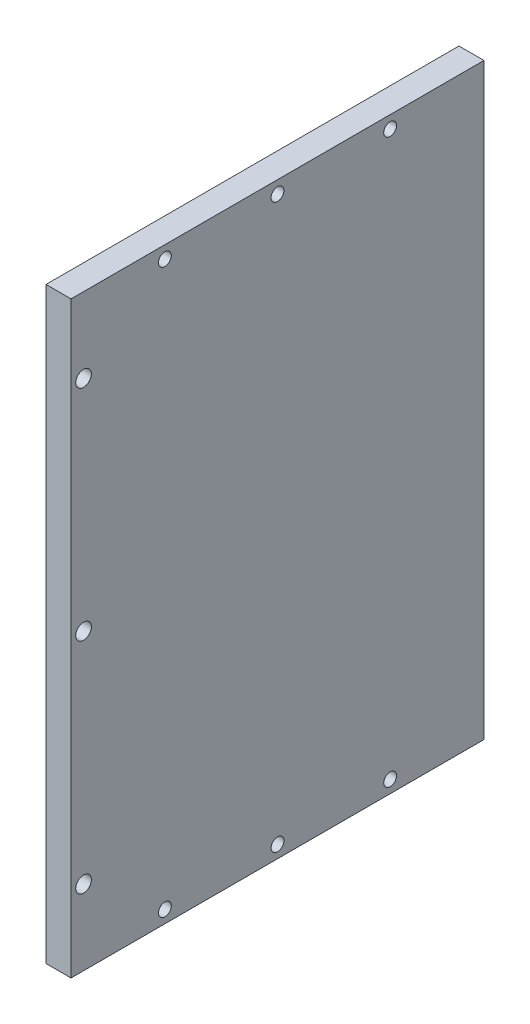
ISO-10303-21;
HEADER;
FILE_DESCRIPTION(('STEP AP214'),'2;1');
FILE_NAME('part.step','',(''),(''),'','','');
FILE_SCHEMA(('AUTOMOTIVE_DESIGN { 1 0 10303 214 1 1 1 1 }'));
ENDSEC;
DATA;
#1=APPLICATION_CONTEXT('core data for automotive mechanical design processes');
#2=APPLICATION_PROTOCOL_DEFINITION('international standard','automotive_design',2000,#1);
#3=PRODUCT_CONTEXT('',#1,'mechanical');
#4=PRODUCT('Part','Part','',(#3));
#5=PRODUCT_RELATED_PRODUCT_CATEGORY('part','',(#4));
#6=PRODUCT_DEFINITION_FORMATION('','',#4);
#7=PRODUCT_DEFINITION_CONTEXT('part definition',#1,'design');
#8=PRODUCT_DEFINITION('design','',#6,#7);
#9=PRODUCT_DEFINITION_SHAPE('','',#8);
#10=(LENGTH_UNIT() NAMED_UNIT(*) SI_UNIT(.MILLI.,.METRE.));
#11=(NAMED_UNIT(*) PLANE_ANGLE_UNIT() SI_UNIT($,.RADIAN.));
#12=(NAMED_UNIT(*) SI_UNIT($,.STERADIAN.) SOLID_ANGLE_UNIT());
#13=UNCERTAINTY_MEASURE_WITH_UNIT(LENGTH_MEASURE(1.E-05),#10,'distance_accuracy_value','');
#14=(GEOMETRIC_REPRESENTATION_CONTEXT(3) GLOBAL_UNCERTAINTY_ASSIGNED_CONTEXT((#13)) GLOBAL_UNIT_ASSIGNED_CONTEXT((#10,
#11,#12)) REPRESENTATION_CONTEXT('',''));
#15=CARTESIAN_POINT('',(0.,0.,0.));
#16=DIRECTION('',(0.,0.,1.));
#17=DIRECTION('',(1.,0.,0.));
#18=AXIS2_PLACEMENT_3D('',#15,#16,#17);
#19=CARTESIAN_POINT('',(4.,0.,0.));
#20=DIRECTION('',(-1.,0.,0.));
#21=DIRECTION('',(0.,0.,1.));
#22=AXIS2_PLACEMENT_3D('',#19,#20,#21);
#23=PLANE('',#22);
#24=CARTESIAN_POINT('',(4.,45.,-15.));
#25=DIRECTION('',(1.,0.,0.));
#26=DIRECTION('',(0.,0.,-1.));
#27=AXIS2_PLACEMENT_3D('',#24,#25,#26);
#28=CIRCLE('',#27,1.02499999999998);
#29=CARTESIAN_POINT('',(4.,45.,-16.025));
#30=VERTEX_POINT('',#29);
#31=EDGE_CURVE('E125',#30,#30,#28,.T.);
#32=ORIENTED_EDGE('',*,*,#31,.F.);
#33=EDGE_LOOP('',(#32));
#34=FACE_BOUND('',#33,.T.);
#35=CARTESIAN_POINT('',(4.,45.,-51.));
#36=DIRECTION('',(1.,0.,0.));
#37=DIRECTION('',(0.,0.,-1.));
#38=AXIS2_PLACEMENT_3D('',#35,#36,#37);
#39=CIRCLE('',#38,1.02499999999998);
#40=CARTESIAN_POINT('',(4.,45.,-52.025));
#41=VERTEX_POINT('',#40);
#42=EDGE_CURVE('E131',#41,#41,#39,.T.);
#43=ORIENTED_EDGE('',*,*,#42,.F.);
#44=EDGE_LOOP('',(#43));
#45=FACE_BOUND('',#44,.T.);
#46=CARTESIAN_POINT('',(4.,-45.,-15.));
#47=DIRECTION('',(1.,0.,0.));
#48=DIRECTION('',(0.,0.,-1.));
#49=AXIS2_PLACEMENT_3D('',#46,#47,#48);
#50=CIRCLE('',#49,1.02499999999998);
#51=CARTESIAN_POINT('',(4.,-45.,-16.025));
#52=VERTEX_POINT('',#51);
#53=EDGE_CURVE('E137',#52,#52,#50,.T.);
#54=ORIENTED_EDGE('',*,*,#53,.F.);
#55=EDGE_LOOP('',(#54));
#56=FACE_BOUND('',#55,.T.);
#57=CARTESIAN_POINT('',(4.,-45.,-51.));
#58=DIRECTION('',(1.,0.,0.));
#59=DIRECTION('',(0.,0.,-1.));
#60=AXIS2_PLACEMENT_3D('',#57,#58,#59);
#61=CIRCLE('',#60,1.02499999999998);
#62=CARTESIAN_POINT('',(4.,-45.,-52.025));
#63=VERTEX_POINT('',#62);
#64=EDGE_CURVE('E143',#63,#63,#61,.T.);
#65=ORIENTED_EDGE('',*,*,#64,.F.);
#66=EDGE_LOOP('',(#65));
#67=FACE_BOUND('',#66,.T.);
#68=CARTESIAN_POINT('',(4.,-45.,-33.));
#69=DIRECTION('',(1.,0.,0.));
#70=DIRECTION('',(0.,0.,-1.));
#71=AXIS2_PLACEMENT_3D('',#68,#69,#70);
#72=CIRCLE('',#71,1.02499999999998);
#73=CARTESIAN_POINT('',(4.,-45.,-34.025));
#74=VERTEX_POINT('',#73);
#75=EDGE_CURVE('E149',#74,#74,#72,.T.);
#76=ORIENTED_EDGE('',*,*,#75,.F.);
#77=EDGE_LOOP('',(#76));
#78=FACE_BOUND('',#77,.T.);
#79=CARTESIAN_POINT('',(4.,45.,-33.));
#80=DIRECTION('',(1.,0.,0.));
#81=DIRECTION('',(0.,0.,-1.));
#82=AXIS2_PLACEMENT_3D('',#79,#80,#81);
#83=CIRCLE('',#82,1.02499999999998);
#84=CARTESIAN_POINT('',(4.,45.,-34.025));
#85=VERTEX_POINT('',#84);
#86=EDGE_CURVE('E155',#85,#85,#83,.T.);
#87=ORIENTED_EDGE('',*,*,#86,.F.);
#88=EDGE_LOOP('',(#87));
#89=FACE_BOUND('',#88,.T.);
#90=DIRECTION('',(0.,-1.,0.));
#91=VECTOR('',#90,1.);
#92=CARTESIAN_POINT('',(4.,0.,0.));
#93=LINE('',#92,#91);
#94=CARTESIAN_POINT('',(4.,47.,0.));
#95=VERTEX_POINT('',#94);
#96=CARTESIAN_POINT('',(4.,-47.,0.));
#97=VERTEX_POINT('',#96);
#98=EDGE_CURVE('E56',#95,#97,#93,.T.);
#99=ORIENTED_EDGE('',*,*,#98,.T.);
#100=DIRECTION('',(0.,0.,-1.));
#101=VECTOR('',#100,1.);
#102=CARTESIAN_POINT('',(4.,-47.,-66.));
#103=LINE('',#102,#101);
#104=CARTESIAN_POINT('',(4.,-47.,-66.));
#105=VERTEX_POINT('',#104);
#106=EDGE_CURVE('E88',#97,#105,#103,.T.);
#107=ORIENTED_EDGE('',*,*,#106,.T.);
#108=DIRECTION('',(0.,1.,0.));
#109=VECTOR('',#108,1.);
#110=CARTESIAN_POINT('',(4.,47.,-66.));
#111=LINE('',#110,#109);
#112=CARTESIAN_POINT('',(4.,47.,-66.));
#113=VERTEX_POINT('',#112);
#114=EDGE_CURVE('E183',#105,#113,#111,.T.);
#115=ORIENTED_EDGE('',*,*,#114,.T.);
#116=DIRECTION('',(0.,0.,1.));
#117=VECTOR('',#116,1.);
#118=CARTESIAN_POINT('',(4.,47.,0.));
#119=LINE('',#118,#117);
#120=EDGE_CURVE('E185',#113,#95,#119,.T.);
#121=ORIENTED_EDGE('',*,*,#120,.T.);
#122=EDGE_LOOP('',(#99,#107,#115,#121));
#123=FACE_BOUND('',#122,.T.);
#124=CARTESIAN_POINT('',(4.,0.,-2.));
#125=DIRECTION('',(1.,0.,0.));
#126=DIRECTION('',(0.,0.,-1.));
#127=AXIS2_PLACEMENT_3D('',#124,#125,#126);
#128=CIRCLE('',#127,1.25);
#129=CARTESIAN_POINT('',(4.,0.,-3.25));
#130=VERTEX_POINT('',#129);
#131=EDGE_CURVE('E174',#130,#130,#128,.T.);
#132=ORIENTED_EDGE('',*,*,#131,.F.);
#133=EDGE_LOOP('',(#132));
#134=FACE_BOUND('',#133,.T.);
#135=CARTESIAN_POINT('',(4.,35.,-1.99999999999988));
#136=DIRECTION('',(1.,0.,0.));
#137=DIRECTION('',(0.,0.,-1.));
#138=AXIS2_PLACEMENT_3D('',#135,#136,#137);
#139=CIRCLE('',#138,1.25);
#140=CARTESIAN_POINT('',(4.,35.,-3.24999999999988));
#141=VERTEX_POINT('',#140);
#142=EDGE_CURVE('E168',#141,#141,#139,.T.);
#143=ORIENTED_EDGE('',*,*,#142,.F.);
#144=EDGE_LOOP('',(#143));
#145=FACE_BOUND('',#144,.T.);
#146=CARTESIAN_POINT('',(4.,-35.,-2.00000000000037));
#147=DIRECTION('',(1.,0.,0.));
#148=DIRECTION('',(0.,0.,-1.));
#149=AXIS2_PLACEMENT_3D('',#146,#147,#148);
#150=CIRCLE('',#149,1.25);
#151=CARTESIAN_POINT('',(4.,-35.,-3.25000000000037));
#152=VERTEX_POINT('',#151);
#153=EDGE_CURVE('E162',#152,#152,#150,.T.);
#154=ORIENTED_EDGE('',*,*,#153,.F.);
#155=EDGE_LOOP('',(#154));
#156=FACE_BOUND('',#155,.T.);
#157=ADVANCED_FACE('F39',(#34,#45,#56,#67,#78,#89,#123,#134,#145,#156),#23,.F.);
#158=CARTESIAN_POINT('',(0.,0.,0.));
#159=DIRECTION('',(-1.,0.,0.));
#160=DIRECTION('',(0.,0.,1.));
#161=AXIS2_PLACEMENT_3D('',#158,#159,#160);
#162=PLANE('',#161);
#163=CARTESIAN_POINT('',(0.,45.,-15.));
#164=DIRECTION('',(1.,0.,0.));
#165=DIRECTION('',(0.,0.,-1.));
#166=AXIS2_PLACEMENT_3D('',#163,#164,#165);
#167=CIRCLE('',#166,1.025);
#168=CARTESIAN_POINT('',(0.,45.,-16.025));
#169=VERTEX_POINT('',#168);
#170=EDGE_CURVE('E128',#169,#169,#167,.T.);
#171=ORIENTED_EDGE('',*,*,#170,.T.);
#172=EDGE_LOOP('',(#171));
#173=FACE_BOUND('',#172,.T.);
#174=CARTESIAN_POINT('',(0.,45.,-51.));
#175=DIRECTION('',(1.,0.,0.));
#176=DIRECTION('',(0.,0.,-1.));
#177=AXIS2_PLACEMENT_3D('',#174,#175,#176);
#178=CIRCLE('',#177,1.025);
#179=CARTESIAN_POINT('',(0.,45.,-52.025));
#180=VERTEX_POINT('',#179);
#181=EDGE_CURVE('E134',#180,#180,#178,.T.);
#182=ORIENTED_EDGE('',*,*,#181,.T.);
#183=EDGE_LOOP('',(#182));
#184=FACE_BOUND('',#183,.T.);
#185=CARTESIAN_POINT('',(0.,-45.,-15.));
#186=DIRECTION('',(1.,0.,0.));
#187=DIRECTION('',(0.,0.,-1.));
#188=AXIS2_PLACEMENT_3D('',#185,#186,#187);
#189=CIRCLE('',#188,1.025);
#190=CARTESIAN_POINT('',(0.,-45.,-16.025));
#191=VERTEX_POINT('',#190);
#192=EDGE_CURVE('E140',#191,#191,#189,.T.);
#193=ORIENTED_EDGE('',*,*,#192,.T.);
#194=EDGE_LOOP('',(#193));
#195=FACE_BOUND('',#194,.T.);
#196=CARTESIAN_POINT('',(0.,-45.,-51.));
#197=DIRECTION('',(1.,0.,0.));
#198=DIRECTION('',(0.,0.,-1.));
#199=AXIS2_PLACEMENT_3D('',#196,#197,#198);
#200=CIRCLE('',#199,1.025);
#201=CARTESIAN_POINT('',(0.,-45.,-52.025));
#202=VERTEX_POINT('',#201);
#203=EDGE_CURVE('E146',#202,#202,#200,.T.);
#204=ORIENTED_EDGE('',*,*,#203,.T.);
#205=EDGE_LOOP('',(#204));
#206=FACE_BOUND('',#205,.T.);
#207=CARTESIAN_POINT('',(0.,-45.,-33.));
#208=DIRECTION('',(1.,0.,0.));
#209=DIRECTION('',(0.,0.,-1.));
#210=AXIS2_PLACEMENT_3D('',#207,#208,#209);
#211=CIRCLE('',#210,1.025);
#212=CARTESIAN_POINT('',(0.,-45.,-34.025));
#213=VERTEX_POINT('',#212);
#214=EDGE_CURVE('E152',#213,#213,#211,.T.);
#215=ORIENTED_EDGE('',*,*,#214,.T.);
#216=EDGE_LOOP('',(#215));
#217=FACE_BOUND('',#216,.T.);
#218=CARTESIAN_POINT('',(0.,45.,-33.));
#219=DIRECTION('',(1.,0.,0.));
#220=DIRECTION('',(0.,0.,-1.));
#221=AXIS2_PLACEMENT_3D('',#218,#219,#220);
#222=CIRCLE('',#221,1.025);
#223=CARTESIAN_POINT('',(0.,45.,-34.025));
#224=VERTEX_POINT('',#223);
#225=EDGE_CURVE('E158',#224,#224,#222,.T.);
#226=ORIENTED_EDGE('',*,*,#225,.T.);
#227=EDGE_LOOP('',(#226));
#228=FACE_BOUND('',#227,.T.);
#229=CARTESIAN_POINT('',(0.,35.,-1.99999999999988));
#230=DIRECTION('',(1.,0.,0.));
#231=DIRECTION('',(0.,0.,-1.));
#232=AXIS2_PLACEMENT_3D('',#229,#230,#231);
#233=CIRCLE('',#232,1.25);
#234=CARTESIAN_POINT('',(0.,35.,-3.24999999999988));
#235=VERTEX_POINT('',#234);
#236=EDGE_CURVE('E165',#235,#235,#233,.T.);
#237=ORIENTED_EDGE('',*,*,#236,.T.);
#238=EDGE_LOOP('',(#237));
#239=FACE_BOUND('',#238,.T.);
#240=DIRECTION('',(0.,0.,-1.));
#241=VECTOR('',#240,1.);
#242=CARTESIAN_POINT('',(0.,-47.,-66.));
#243=LINE('',#242,#241);
#244=CARTESIAN_POINT('',(0.,-47.,0.));
#245=VERTEX_POINT('',#244);
#246=CARTESIAN_POINT('',(0.,-47.,-66.));
#247=VERTEX_POINT('',#246);
#248=EDGE_CURVE('E177',#245,#247,#243,.T.);
#249=ORIENTED_EDGE('',*,*,#248,.F.);
#250=DIRECTION('',(0.,-1.,0.));
#251=VECTOR('',#250,1.);
#252=CARTESIAN_POINT('',(0.,0.,0.));
#253=LINE('',#252,#251);
#254=CARTESIAN_POINT('',(0.,47.,0.));
#255=VERTEX_POINT('',#254);
#256=EDGE_CURVE('E181',#255,#245,#253,.T.);
#257=ORIENTED_EDGE('',*,*,#256,.F.);
#258=DIRECTION('',(0.,0.,1.));
#259=VECTOR('',#258,1.);
#260=CARTESIAN_POINT('',(0.,47.,0.));
#261=LINE('',#260,#259);
#262=CARTESIAN_POINT('',(0.,47.,-66.));
#263=VERTEX_POINT('',#262);
#264=EDGE_CURVE('E82',#263,#255,#261,.T.);
#265=ORIENTED_EDGE('',*,*,#264,.F.);
#266=DIRECTION('',(0.,1.,0.));
#267=VECTOR('',#266,1.);
#268=CARTESIAN_POINT('',(0.,47.,-66.));
#269=LINE('',#268,#267);
#270=EDGE_CURVE('E75',#247,#263,#269,.T.);
#271=ORIENTED_EDGE('',*,*,#270,.F.);
#272=EDGE_LOOP('',(#249,#257,#265,#271));
#273=FACE_BOUND('',#272,.T.);
#274=CARTESIAN_POINT('',(0.,0.,-2.));
#275=DIRECTION('',(1.,0.,0.));
#276=DIRECTION('',(0.,0.,-1.));
#277=AXIS2_PLACEMENT_3D('',#274,#275,#276);
#278=CIRCLE('',#277,1.25);
#279=CARTESIAN_POINT('',(0.,0.,-3.25));
#280=VERTEX_POINT('',#279);
#281=EDGE_CURVE('E171',#280,#280,#278,.T.);
#282=ORIENTED_EDGE('',*,*,#281,.T.);
#283=EDGE_LOOP('',(#282));
#284=FACE_BOUND('',#283,.T.);
#285=CARTESIAN_POINT('',(0.,-35.,-2.00000000000037));
#286=DIRECTION('',(1.,0.,0.));
#287=DIRECTION('',(0.,0.,-1.));
#288=AXIS2_PLACEMENT_3D('',#285,#286,#287);
#289=CIRCLE('',#288,1.25);
#290=CARTESIAN_POINT('',(0.,-35.,-3.25000000000037));
#291=VERTEX_POINT('',#290);
#292=EDGE_CURVE('E161',#291,#291,#289,.T.);
#293=ORIENTED_EDGE('',*,*,#292,.T.);
#294=EDGE_LOOP('',(#293));
#295=FACE_BOUND('',#294,.T.);
#296=ADVANCED_FACE('F198',(#173,#184,#195,#206,#217,#228,#239,#273,#284,#295),#162,.T.);
#297=CARTESIAN_POINT('',(4.,-47.,-66.));
#298=DIRECTION('',(0.,1.,0.));
#299=DIRECTION('',(0.,0.,1.));
#300=AXIS2_PLACEMENT_3D('',#297,#298,#299);
#301=PLANE('',#300);
#302=ORIENTED_EDGE('',*,*,#248,.T.);
#303=DIRECTION('',(-1.,0.,0.));
#304=VECTOR('',#303,1.);
#305=CARTESIAN_POINT('',(4.,-47.,-66.));
#306=LINE('',#305,#304);
#307=EDGE_CURVE('E48',#105,#247,#306,.T.);
#308=ORIENTED_EDGE('',*,*,#307,.F.);
#309=ORIENTED_EDGE('',*,*,#106,.F.);
#310=DIRECTION('',(-1.,0.,0.));
#311=VECTOR('',#310,1.);
#312=CARTESIAN_POINT('',(4.,-47.,0.));
#313=LINE('',#312,#311);
#314=EDGE_CURVE('E11',#97,#245,#313,.T.);
#315=ORIENTED_EDGE('',*,*,#314,.T.);
#316=EDGE_LOOP('',(#302,#308,#309,#315));
#317=FACE_BOUND('',#316,.T.);
#318=ADVANCED_FACE('F41',(#317),#301,.F.);
#319=CARTESIAN_POINT('',(4.,47.,-66.));
#320=DIRECTION('',(0.,0.,1.));
#321=DIRECTION('',(1.,0.,0.));
#322=AXIS2_PLACEMENT_3D('',#319,#320,#321);
#323=PLANE('',#322);
#324=CARTESIAN_POINT('',(2.00000000000012,35.,-66.));
#325=DIRECTION('',(0.,0.,-1.));
#326=DIRECTION('',(-1.,0.,0.));
#327=AXIS2_PLACEMENT_3D('',#324,#325,#326);
#328=CIRCLE('',#327,1.02499999999999);
#329=CARTESIAN_POINT('',(0.975000000000133,35.,-66.));
#330=VERTEX_POINT('',#329);
#331=EDGE_CURVE('E109',#330,#330,#328,.T.);
#332=ORIENTED_EDGE('',*,*,#331,.F.);
#333=EDGE_LOOP('',(#332));
#334=FACE_BOUND('',#333,.T.);
#335=CARTESIAN_POINT('',(2.,0.,-66.));
#336=DIRECTION('',(0.,0.,-1.));
#337=DIRECTION('',(-1.,0.,0.));
#338=AXIS2_PLACEMENT_3D('',#335,#336,#337);
#339=CIRCLE('',#338,1.02499999999999);
#340=CARTESIAN_POINT('',(0.975000000000011,0.,-66.));
#341=VERTEX_POINT('',#340);
#342=EDGE_CURVE('E108',#341,#341,#339,.T.);
#343=ORIENTED_EDGE('',*,*,#342,.F.);
#344=EDGE_LOOP('',(#343));
#345=FACE_BOUND('',#344,.T.);
#346=CARTESIAN_POINT('',(1.99999999999963,-35.,-66.));
#347=DIRECTION('',(0.,0.,-1.));
#348=DIRECTION('',(-1.,0.,0.));
#349=AXIS2_PLACEMENT_3D('',#346,#347,#348);
#350=CIRCLE('',#349,1.02499999999999);
#351=CARTESIAN_POINT('',(0.974999999999644,-35.,-66.));
#352=VERTEX_POINT('',#351);
#353=EDGE_CURVE('E119',#352,#352,#350,.T.);
#354=ORIENTED_EDGE('',*,*,#353,.F.);
#355=EDGE_LOOP('',(#354));
#356=FACE_BOUND('',#355,.T.);
#357=ORIENTED_EDGE('',*,*,#270,.T.);
#358=DIRECTION('',(-1.,0.,0.));
#359=VECTOR('',#358,1.);
#360=CARTESIAN_POINT('',(4.,47.,-66.));
#361=LINE('',#360,#359);
#362=EDGE_CURVE('E193',#113,#263,#361,.T.);
#363=ORIENTED_EDGE('',*,*,#362,.F.);
#364=ORIENTED_EDGE('',*,*,#114,.F.);
#365=ORIENTED_EDGE('',*,*,#307,.T.);
#366=EDGE_LOOP('',(#357,#363,#364,#365));
#367=FACE_BOUND('',#366,.T.);
#368=ADVANCED_FACE('F195',(#334,#345,#356,#367),#323,.F.);
#369=CARTESIAN_POINT('',(4.,47.,0.));
#370=DIRECTION('',(0.,-1.,0.));
#371=DIRECTION('',(0.,0.,-1.));
#372=AXIS2_PLACEMENT_3D('',#369,#370,#371);
#373=PLANE('',#372);
#374=ORIENTED_EDGE('',*,*,#264,.T.);
#375=DIRECTION('',(-1.,0.,0.));
#376=VECTOR('',#375,1.);
#377=CARTESIAN_POINT('',(4.,47.,0.));
#378=LINE('',#377,#376);
#379=EDGE_CURVE('E187',#95,#255,#378,.T.);
#380=ORIENTED_EDGE('',*,*,#379,.F.);
#381=ORIENTED_EDGE('',*,*,#120,.F.);
#382=ORIENTED_EDGE('',*,*,#362,.T.);
#383=EDGE_LOOP('',(#374,#380,#381,#382));
#384=FACE_BOUND('',#383,.T.);
#385=ADVANCED_FACE('F203',(#384),#373,.F.);
#386=CARTESIAN_POINT('',(4.,0.,0.));
#387=DIRECTION('',(0.,0.,-1.));
#388=DIRECTION('',(-1.,0.,0.));
#389=AXIS2_PLACEMENT_3D('',#386,#387,#388);
#390=PLANE('',#389);
#391=ORIENTED_EDGE('',*,*,#256,.T.);
#392=ORIENTED_EDGE('',*,*,#314,.F.);
#393=ORIENTED_EDGE('',*,*,#98,.F.);
#394=ORIENTED_EDGE('',*,*,#379,.T.);
#395=EDGE_LOOP('',(#391,#392,#393,#394));
#396=FACE_BOUND('',#395,.T.);
#397=ADVANCED_FACE('F201',(#396),#390,.F.);
#398=CARTESIAN_POINT('',(4.,0.,-2.));
#399=DIRECTION('',(-1.,0.,0.));
#400=DIRECTION('',(0.,0.,1.));
#401=AXIS2_PLACEMENT_3D('',#398,#399,#400);
#402=CYLINDRICAL_SURFACE('',#401,1.25);
#403=ORIENTED_EDGE('',*,*,#131,.T.);
#404=EDGE_LOOP('',(#403));
#405=FACE_BOUND('',#404,.T.);
#406=ORIENTED_EDGE('',*,*,#281,.F.);
#407=EDGE_LOOP('',(#406));
#408=FACE_BOUND('',#407,.T.);
#409=ADVANCED_FACE('F234',(#405,#408),#402,.F.);
#410=CARTESIAN_POINT('',(4.,35.,-1.99999999999988));
#411=DIRECTION('',(-1.,0.,0.));
#412=DIRECTION('',(0.,0.,1.));
#413=AXIS2_PLACEMENT_3D('',#410,#411,#412);
#414=CYLINDRICAL_SURFACE('',#413,1.25);
#415=ORIENTED_EDGE('',*,*,#142,.T.);
#416=EDGE_LOOP('',(#415));
#417=FACE_BOUND('',#416,.T.);
#418=ORIENTED_EDGE('',*,*,#236,.F.);
#419=EDGE_LOOP('',(#418));
#420=FACE_BOUND('',#419,.T.);
#421=ADVANCED_FACE('F219',(#417,#420),#414,.F.);
#422=CARTESIAN_POINT('',(4.,-35.,-2.00000000000037));
#423=DIRECTION('',(-1.,0.,0.));
#424=DIRECTION('',(0.,0.,1.));
#425=AXIS2_PLACEMENT_3D('',#422,#423,#424);
#426=CYLINDRICAL_SURFACE('',#425,1.25);
#427=ORIENTED_EDGE('',*,*,#153,.T.);
#428=EDGE_LOOP('',(#427));
#429=FACE_BOUND('',#428,.T.);
#430=ORIENTED_EDGE('',*,*,#292,.F.);
#431=EDGE_LOOP('',(#430));
#432=FACE_BOUND('',#431,.T.);
#433=ADVANCED_FACE('F215',(#429,#432),#426,.F.);
#434=CARTESIAN_POINT('',(4.,45.,-33.));
#435=DIRECTION('',(1.,0.,0.));
#436=DIRECTION('',(0.,0.,-1.));
#437=AXIS2_PLACEMENT_3D('',#434,#435,#436);
#438=CYLINDRICAL_SURFACE('',#437,1.02499999999999);
#439=ORIENTED_EDGE('',*,*,#225,.F.);
#440=EDGE_LOOP('',(#439));
#441=FACE_BOUND('',#440,.T.);
#442=ORIENTED_EDGE('',*,*,#86,.T.);
#443=EDGE_LOOP('',(#442));
#444=FACE_BOUND('',#443,.T.);
#445=ADVANCED_FACE('F218',(#441,#444),#438,.F.);
#446=CARTESIAN_POINT('',(4.,-45.,-33.));
#447=DIRECTION('',(1.,0.,0.));
#448=DIRECTION('',(0.,0.,-1.));
#449=AXIS2_PLACEMENT_3D('',#446,#447,#448);
#450=CYLINDRICAL_SURFACE('',#449,1.02499999999999);
#451=ORIENTED_EDGE('',*,*,#214,.F.);
#452=EDGE_LOOP('',(#451));
#453=FACE_BOUND('',#452,.T.);
#454=ORIENTED_EDGE('',*,*,#75,.T.);
#455=EDGE_LOOP('',(#454));
#456=FACE_BOUND('',#455,.T.);
#457=ADVANCED_FACE('F280',(#453,#456),#450,.F.);
#458=CARTESIAN_POINT('',(4.,-45.,-51.));
#459=DIRECTION('',(1.,0.,0.));
#460=DIRECTION('',(0.,0.,-1.));
#461=AXIS2_PLACEMENT_3D('',#458,#459,#460);
#462=CYLINDRICAL_SURFACE('',#461,1.02499999999999);
#463=ORIENTED_EDGE('',*,*,#203,.F.);
#464=EDGE_LOOP('',(#463));
#465=FACE_BOUND('',#464,.T.);
#466=ORIENTED_EDGE('',*,*,#64,.T.);
#467=EDGE_LOOP('',(#466));
#468=FACE_BOUND('',#467,.T.);
#469=ADVANCED_FACE('F276',(#465,#468),#462,.F.);
#470=CARTESIAN_POINT('',(4.,-45.,-15.));
#471=DIRECTION('',(1.,0.,0.));
#472=DIRECTION('',(0.,0.,-1.));
#473=AXIS2_PLACEMENT_3D('',#470,#471,#472);
#474=CYLINDRICAL_SURFACE('',#473,1.02499999999999);
#475=ORIENTED_EDGE('',*,*,#192,.F.);
#476=EDGE_LOOP('',(#475));
#477=FACE_BOUND('',#476,.T.);
#478=ORIENTED_EDGE('',*,*,#53,.T.);
#479=EDGE_LOOP('',(#478));
#480=FACE_BOUND('',#479,.T.);
#481=ADVANCED_FACE('F272',(#477,#480),#474,.F.);
#482=CARTESIAN_POINT('',(4.,45.,-51.));
#483=DIRECTION('',(1.,0.,0.));
#484=DIRECTION('',(0.,0.,-1.));
#485=AXIS2_PLACEMENT_3D('',#482,#483,#484);
#486=CYLINDRICAL_SURFACE('',#485,1.02499999999999);
#487=ORIENTED_EDGE('',*,*,#181,.F.);
#488=EDGE_LOOP('',(#487));
#489=FACE_BOUND('',#488,.T.);
#490=ORIENTED_EDGE('',*,*,#42,.T.);
#491=EDGE_LOOP('',(#490));
#492=FACE_BOUND('',#491,.T.);
#493=ADVANCED_FACE('F268',(#489,#492),#486,.F.);
#494=CARTESIAN_POINT('',(4.,45.,-15.));
#495=DIRECTION('',(1.,0.,0.));
#496=DIRECTION('',(0.,0.,-1.));
#497=AXIS2_PLACEMENT_3D('',#494,#495,#496);
#498=CYLINDRICAL_SURFACE('',#497,1.02499999999999);
#499=ORIENTED_EDGE('',*,*,#170,.F.);
#500=EDGE_LOOP('',(#499));
#501=FACE_BOUND('',#500,.T.);
#502=ORIENTED_EDGE('',*,*,#31,.T.);
#503=EDGE_LOOP('',(#502));
#504=FACE_BOUND('',#503,.T.);
#505=ADVANCED_FACE('F260',(#501,#504),#498,.F.);
#506=CARTESIAN_POINT('',(1.99999999999963,-35.,-58.75));
#507=DIRECTION('',(0.,0.,-1.));
#508=DIRECTION('',(-1.,0.,0.));
#509=AXIS2_PLACEMENT_3D('',#506,#507,#508);
#510=CONICAL_SURFACE('',#509,1.02499999999999,1.02974425867665);
#511=CARTESIAN_POINT('',(1.99999999999963,-35.,-58.1341178654968));
#512=VERTEX_POINT('',#511);
#513=VERTEX_LOOP('',#512);
#514=FACE_BOUND('',#513,.T.);
#515=CARTESIAN_POINT('',(1.99999999999963,-35.,-58.75));
#516=DIRECTION('',(0.,0.,-1.));
#517=DIRECTION('',(-1.,0.,0.));
#518=AXIS2_PLACEMENT_3D('',#515,#516,#517);
#519=CIRCLE('',#518,1.02499999999999);
#520=CARTESIAN_POINT('',(0.974999999999646,-35.,-58.75));
#521=VERTEX_POINT('',#520);
#522=EDGE_CURVE('E122',#521,#521,#519,.T.);
#523=ORIENTED_EDGE('',*,*,#522,.T.);
#524=EDGE_LOOP('',(#523));
#525=FACE_BOUND('',#524,.T.);
#526=ADVANCED_FACE('F251',(#514,#525),#510,.F.);
#527=CARTESIAN_POINT('',(1.99999999999963,-35.,-66.));
#528=DIRECTION('',(0.,0.,-1.));
#529=DIRECTION('',(-1.,0.,0.));
#530=AXIS2_PLACEMENT_3D('',#527,#528,#529);
#531=CYLINDRICAL_SURFACE('',#530,1.02499999999999);
#532=ORIENTED_EDGE('',*,*,#522,.F.);
#533=EDGE_LOOP('',(#532));
#534=FACE_BOUND('',#533,.T.);
#535=ORIENTED_EDGE('',*,*,#353,.T.);
#536=EDGE_LOOP('',(#535));
#537=FACE_BOUND('',#536,.T.);
#538=ADVANCED_FACE('F248',(#534,#537),#531,.F.);
#539=CARTESIAN_POINT('',(2.,0.,-58.75));
#540=DIRECTION('',(0.,0.,-1.));
#541=DIRECTION('',(-1.,0.,0.));
#542=AXIS2_PLACEMENT_3D('',#539,#540,#541);
#543=CONICAL_SURFACE('',#542,1.02499999999999,1.02974425867665);
#544=CARTESIAN_POINT('',(2.,0.,-58.1341178654968));
#545=VERTEX_POINT('',#544);
#546=VERTEX_LOOP('',#545);
#547=FACE_BOUND('',#546,.T.);
#548=CARTESIAN_POINT('',(2.,0.,-58.75));
#549=DIRECTION('',(0.,0.,-1.));
#550=DIRECTION('',(-1.,0.,0.));
#551=AXIS2_PLACEMENT_3D('',#548,#549,#550);
#552=CIRCLE('',#551,1.02499999999999);
#553=CARTESIAN_POINT('',(0.975000000000012,0.,-58.75));
#554=VERTEX_POINT('',#553);
#555=EDGE_CURVE('E112',#554,#554,#552,.T.);
#556=ORIENTED_EDGE('',*,*,#555,.T.);
#557=EDGE_LOOP('',(#556));
#558=FACE_BOUND('',#557,.T.);
#559=ADVANCED_FACE('F250',(#547,#558),#543,.F.);
#560=CARTESIAN_POINT('',(2.,0.,-66.));
#561=DIRECTION('',(0.,0.,-1.));
#562=DIRECTION('',(-1.,0.,0.));
#563=AXIS2_PLACEMENT_3D('',#560,#561,#562);
#564=CYLINDRICAL_SURFACE('',#563,1.02499999999999);
#565=ORIENTED_EDGE('',*,*,#555,.F.);
#566=EDGE_LOOP('',(#565));
#567=FACE_BOUND('',#566,.T.);
#568=ORIENTED_EDGE('',*,*,#342,.T.);
#569=EDGE_LOOP('',(#568));
#570=FACE_BOUND('',#569,.T.);
#571=ADVANCED_FACE('F102',(#567,#570),#564,.F.);
#572=CARTESIAN_POINT('',(2.00000000000012,35.,-58.75));
#573=DIRECTION('',(0.,0.,-1.));
#574=DIRECTION('',(-1.,0.,0.));
#575=AXIS2_PLACEMENT_3D('',#572,#573,#574);
#576=CONICAL_SURFACE('',#575,1.02499999999999,1.02974425867665);
#577=CARTESIAN_POINT('',(2.00000000000012,35.,-58.1341178654968));
#578=VERTEX_POINT('',#577);
#579=VERTEX_LOOP('',#578);
#580=FACE_BOUND('',#579,.T.);
#581=CARTESIAN_POINT('',(2.00000000000012,35.,-58.75));
#582=DIRECTION('',(0.,0.,-1.));
#583=DIRECTION('',(-1.,0.,0.));
#584=AXIS2_PLACEMENT_3D('',#581,#582,#583);
#585=CIRCLE('',#584,1.02499999999999);
#586=CARTESIAN_POINT('',(0.975000000000135,35.,-58.75));
#587=VERTEX_POINT('',#586);
#588=EDGE_CURVE('E106',#587,#587,#585,.T.);
#589=ORIENTED_EDGE('',*,*,#588,.T.);
#590=EDGE_LOOP('',(#589));
#591=FACE_BOUND('',#590,.T.);
#592=ADVANCED_FACE('F98',(#580,#591),#576,.F.);
#593=CARTESIAN_POINT('',(2.00000000000012,35.,-66.));
#594=DIRECTION('',(0.,0.,-1.));
#595=DIRECTION('',(-1.,0.,0.));
#596=AXIS2_PLACEMENT_3D('',#593,#594,#595);
#597=CYLINDRICAL_SURFACE('',#596,1.02499999999999);
#598=ORIENTED_EDGE('',*,*,#588,.F.);
#599=EDGE_LOOP('',(#598));
#600=FACE_BOUND('',#599,.T.);
#601=ORIENTED_EDGE('',*,*,#331,.T.);
#602=EDGE_LOOP('',(#601));
#603=FACE_BOUND('',#602,.T.);
#604=ADVANCED_FACE('F101',(#600,#603),#597,.F.);
#605=CLOSED_SHELL('',(#157,#296,#318,#368,#385,#397,#409,#421,#433,#445,#457,#469,#481,#493,
#505,#526,#538,#559,#571,#592,#604));
#606=MANIFOLD_SOLID_BREP('B2',#605);
#607=ADVANCED_BREP_SHAPE_REPRESENTATION('',(#18,#606),#14);
#608=SHAPE_DEFINITION_REPRESENTATION(#9,#607);
ENDSEC;
END-ISO-10303-21;
